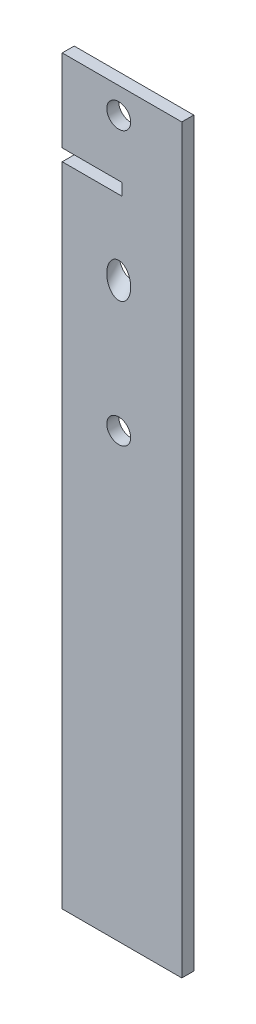
ISO-10303-21;
HEADER;
FILE_DESCRIPTION(('STEP AP214'),'2;1');
FILE_NAME('part.step','',(''),(''),'','','');
FILE_SCHEMA(('AUTOMOTIVE_DESIGN { 1 0 10303 214 1 1 1 1 }'));
ENDSEC;
DATA;
#1=APPLICATION_CONTEXT('core data for automotive mechanical design processes');
#2=APPLICATION_PROTOCOL_DEFINITION('international standard','automotive_design',2000,#1);
#3=PRODUCT_CONTEXT('',#1,'mechanical');
#4=PRODUCT('Part','Part','',(#3));
#5=PRODUCT_RELATED_PRODUCT_CATEGORY('part','',(#4));
#6=PRODUCT_DEFINITION_FORMATION('','',#4);
#7=PRODUCT_DEFINITION_CONTEXT('part definition',#1,'design');
#8=PRODUCT_DEFINITION('design','',#6,#7);
#9=PRODUCT_DEFINITION_SHAPE('','',#8);
#10=(LENGTH_UNIT() NAMED_UNIT(*) SI_UNIT(.MILLI.,.METRE.));
#11=(NAMED_UNIT(*) PLANE_ANGLE_UNIT() SI_UNIT($,.RADIAN.));
#12=(NAMED_UNIT(*) SI_UNIT($,.STERADIAN.) SOLID_ANGLE_UNIT());
#13=UNCERTAINTY_MEASURE_WITH_UNIT(LENGTH_MEASURE(1.E-05),#10,'distance_accuracy_value','');
#14=(GEOMETRIC_REPRESENTATION_CONTEXT(3) GLOBAL_UNCERTAINTY_ASSIGNED_CONTEXT((#13)) GLOBAL_UNIT_ASSIGNED_CONTEXT((#10,
#11,#12)) REPRESENTATION_CONTEXT('',''));
#15=CARTESIAN_POINT('',(0.,0.,0.));
#16=DIRECTION('',(0.,0.,1.));
#17=DIRECTION('',(1.,0.,0.));
#18=AXIS2_PLACEMENT_3D('',#15,#16,#17);
#19=CARTESIAN_POINT('',(2540.,317.5,131.142086105115));
#20=DIRECTION('',(1.,0.,0.));
#21=DIRECTION('',(0.,0.,-1.));
#22=AXIS2_PLACEMENT_3D('',#19,#20,#21);
#23=PLANE('',#22);
#24=DIRECTION('',(0.,0.,1.));
#25=VECTOR('',#24,1.);
#26=CARTESIAN_POINT('',(2540.,217.4,-190.5));
#27=LINE('',#26,#25);
#28=CARTESIAN_POINT('',(2540.,217.4,131.142086105115));
#29=VERTEX_POINT('',#28);
#30=CARTESIAN_POINT('',(2540.,217.4,143.842086105115));
#31=VERTEX_POINT('',#30);
#32=EDGE_CURVE('E95',#29,#31,#27,.T.);
#33=ORIENTED_EDGE('',*,*,#32,.F.);
#34=DIRECTION('',(0.,-1.,0.));
#35=VECTOR('',#34,1.);
#36=CARTESIAN_POINT('',(2540.,317.5,131.142086105115));
#37=LINE('',#36,#35);
#38=CARTESIAN_POINT('',(2540.,-469.9,131.142086105115));
#39=VERTEX_POINT('',#38);
#40=EDGE_CURVE('E104',#29,#39,#37,.T.);
#41=ORIENTED_EDGE('',*,*,#40,.T.);
#42=DIRECTION('',(0.,0.,1.));
#43=VECTOR('',#42,1.);
#44=CARTESIAN_POINT('',(2540.,-469.9,131.142086105115));
#45=LINE('',#44,#43);
#46=CARTESIAN_POINT('',(2540.,-469.9,143.842086105115));
#47=VERTEX_POINT('',#46);
#48=EDGE_CURVE('E107',#39,#47,#45,.T.);
#49=ORIENTED_EDGE('',*,*,#48,.T.);
#50=DIRECTION('',(0.,-1.,0.));
#51=VECTOR('',#50,1.);
#52=CARTESIAN_POINT('',(2540.,317.5,143.842086105115));
#53=LINE('',#52,#51);
#54=EDGE_CURVE('E61',#31,#47,#53,.T.);
#55=ORIENTED_EDGE('',*,*,#54,.F.);
#56=EDGE_LOOP('',(#33,#41,#49,#55));
#57=FACE_BOUND('',#56,.T.);
#58=ADVANCED_FACE('F37',(#57),#23,.F.);
#59=CARTESIAN_POINT('',(2540.,317.5,131.142086105115));
#60=VERTEX_POINT('',#59);
#61=CARTESIAN_POINT('',(2540.,230.1,131.142086105115));
#62=VERTEX_POINT('',#61);
#63=EDGE_CURVE('E110',#60,#62,#37,.T.);
#64=ORIENTED_EDGE('',*,*,#63,.T.);
#65=DIRECTION('',(0.,0.,1.));
#66=VECTOR('',#65,1.);
#67=CARTESIAN_POINT('',(2540.,230.1,-190.5));
#68=LINE('',#67,#66);
#69=CARTESIAN_POINT('',(2540.,230.1,143.842086105115));
#70=VERTEX_POINT('',#69);
#71=EDGE_CURVE('E52',#62,#70,#68,.T.);
#72=ORIENTED_EDGE('',*,*,#71,.T.);
#73=CARTESIAN_POINT('',(2540.,317.5,143.842086105115));
#74=VERTEX_POINT('',#73);
#75=EDGE_CURVE('E164',#74,#70,#53,.T.);
#76=ORIENTED_EDGE('',*,*,#75,.F.);
#77=DIRECTION('',(0.,0.,1.));
#78=VECTOR('',#77,1.);
#79=CARTESIAN_POINT('',(2540.,317.5,131.142086105115));
#80=LINE('',#79,#78);
#81=EDGE_CURVE('E137',#60,#74,#80,.T.);
#82=ORIENTED_EDGE('',*,*,#81,.F.);
#83=EDGE_LOOP('',(#64,#72,#76,#82));
#84=FACE_BOUND('',#83,.T.);
#85=ADVANCED_FACE('F159',(#84),#23,.F.);
#86=CARTESIAN_POINT('',(2540.,317.5,143.842086105115));
#87=DIRECTION('',(0.,0.,-1.));
#88=DIRECTION('',(-1.,0.,0.));
#89=AXIS2_PLACEMENT_3D('',#86,#87,#88);
#90=PLANE('',#89);
#91=CARTESIAN_POINT('',(2599.99999999996,289.999999999996,143.842086105115));
#92=DIRECTION('',(0.,0.,-1.));
#93=DIRECTION('',(-1.,0.,0.));
#94=AXIS2_PLACEMENT_3D('',#91,#92,#93);
#95=CIRCLE('',#94,12.6999999999999);
#96=CARTESIAN_POINT('',(2587.29999999996,289.999999999996,143.842086105115));
#97=VERTEX_POINT('',#96);
#98=EDGE_CURVE('E139',#97,#97,#95,.F.);
#99=ORIENTED_EDGE('',*,*,#98,.F.);
#100=EDGE_LOOP('',(#99));
#101=FACE_BOUND('',#100,.T.);
#102=ORIENTED_EDGE('',*,*,#75,.T.);
#103=DIRECTION('',(1.,0.,0.));
#104=VECTOR('',#103,1.);
#105=CARTESIAN_POINT('',(2540.,230.1,143.842086105115));
#106=LINE('',#105,#104);
#107=CARTESIAN_POINT('',(2603.5,230.1,143.842086105115));
#108=VERTEX_POINT('',#107);
#109=EDGE_CURVE('E126',#70,#108,#106,.T.);
#110=ORIENTED_EDGE('',*,*,#109,.T.);
#111=DIRECTION('',(0.,1.,0.));
#112=VECTOR('',#111,1.);
#113=CARTESIAN_POINT('',(2603.5,217.4,143.842086105115));
#114=LINE('',#113,#112);
#115=CARTESIAN_POINT('',(2603.5,217.4,143.842086105115));
#116=VERTEX_POINT('',#115);
#117=EDGE_CURVE('E176',#116,#108,#114,.T.);
#118=ORIENTED_EDGE('',*,*,#117,.F.);
#119=DIRECTION('',(1.,0.,0.));
#120=VECTOR('',#119,1.);
#121=CARTESIAN_POINT('',(2540.,217.4,143.842086105115));
#122=LINE('',#121,#120);
#123=EDGE_CURVE('E124',#31,#116,#122,.T.);
#124=ORIENTED_EDGE('',*,*,#123,.F.);
#125=ORIENTED_EDGE('',*,*,#54,.T.);
#126=DIRECTION('',(1.,0.,0.));
#127=VECTOR('',#126,1.);
#128=CARTESIAN_POINT('',(2540.,-469.9,143.842086105115));
#129=LINE('',#128,#127);
#130=CARTESIAN_POINT('',(2667.,-469.9,143.842086105115));
#131=VERTEX_POINT('',#130);
#132=EDGE_CURVE('E123',#47,#131,#129,.T.);
#133=ORIENTED_EDGE('',*,*,#132,.T.);
#134=DIRECTION('',(0.,-1.,0.));
#135=VECTOR('',#134,1.);
#136=CARTESIAN_POINT('',(2667.,317.5,143.842086105115));
#137=LINE('',#136,#135);
#138=CARTESIAN_POINT('',(2667.,317.5,143.842086105115));
#139=VERTEX_POINT('',#138);
#140=EDGE_CURVE('E88',#139,#131,#137,.T.);
#141=ORIENTED_EDGE('',*,*,#140,.F.);
#142=DIRECTION('',(1.,0.,0.));
#143=VECTOR('',#142,1.);
#144=CARTESIAN_POINT('',(2540.,317.5,143.842086105115));
#145=LINE('',#144,#143);
#146=EDGE_CURVE('E80',#74,#139,#145,.T.);
#147=ORIENTED_EDGE('',*,*,#146,.F.);
#148=EDGE_LOOP('',(#102,#110,#118,#124,#125,#133,#141,#147));
#149=FACE_BOUND('',#148,.T.);
#150=CARTESIAN_POINT('',(2599.99999999996,138.311981925511,143.842086105115));
#151=DIRECTION('',(0.,0.,-1.));
#152=DIRECTION('',(0.,-1.,0.));
#153=AXIS2_PLACEMENT_3D('',#150,#151,#152);
#154=ELLIPSE('',#153,18.4568454455697,12.6999999999999);
#155=CARTESIAN_POINT('',(2599.99999999996,119.855136479941,143.842086105115));
#156=VERTEX_POINT('',#155);
#157=EDGE_CURVE('E147',#156,#156,#154,.F.);
#158=ORIENTED_EDGE('',*,*,#157,.F.);
#159=EDGE_LOOP('',(#158));
#160=FACE_BOUND('',#159,.T.);
#161=CARTESIAN_POINT('',(2599.99999999996,-3.18538321897636E-12,143.842086105115));
#162=DIRECTION('',(0.,0.,-1.));
#163=DIRECTION('',(-1.,0.,0.));
#164=AXIS2_PLACEMENT_3D('',#161,#162,#163);
#165=CIRCLE('',#164,12.6999999999999);
#166=CARTESIAN_POINT('',(2587.29999999996,-3.18538321897636E-12,143.842086105115));
#167=VERTEX_POINT('',#166);
#168=EDGE_CURVE('E143',#167,#167,#165,.F.);
#169=ORIENTED_EDGE('',*,*,#168,.F.);
#170=EDGE_LOOP('',(#169));
#171=FACE_BOUND('',#170,.T.);
#172=ADVANCED_FACE('F39',(#101,#149,#160,#171),#90,.F.);
#173=CARTESIAN_POINT('',(2667.,317.5,131.142086105115));
#174=DIRECTION('',(-1.,0.,0.));
#175=DIRECTION('',(0.,0.,1.));
#176=AXIS2_PLACEMENT_3D('',#173,#174,#175);
#177=PLANE('',#176);
#178=DIRECTION('',(0.,0.,-1.));
#179=VECTOR('',#178,1.);
#180=CARTESIAN_POINT('',(2667.,-469.9,131.142086105115));
#181=LINE('',#180,#179);
#182=CARTESIAN_POINT('',(2667.,-469.9,131.142086105115));
#183=VERTEX_POINT('',#182);
#184=EDGE_CURVE('E163',#131,#183,#181,.T.);
#185=ORIENTED_EDGE('',*,*,#184,.T.);
#186=DIRECTION('',(0.,-1.,0.));
#187=VECTOR('',#186,1.);
#188=CARTESIAN_POINT('',(2667.,317.5,131.142086105115));
#189=LINE('',#188,#187);
#190=CARTESIAN_POINT('',(2667.,317.5,131.142086105115));
#191=VERTEX_POINT('',#190);
#192=EDGE_CURVE('E118',#191,#183,#189,.T.);
#193=ORIENTED_EDGE('',*,*,#192,.F.);
#194=DIRECTION('',(0.,0.,-1.));
#195=VECTOR('',#194,1.);
#196=CARTESIAN_POINT('',(2667.,317.5,131.142086105115));
#197=LINE('',#196,#195);
#198=EDGE_CURVE('E134',#139,#191,#197,.T.);
#199=ORIENTED_EDGE('',*,*,#198,.F.);
#200=ORIENTED_EDGE('',*,*,#140,.T.);
#201=EDGE_LOOP('',(#185,#193,#199,#200));
#202=FACE_BOUND('',#201,.T.);
#203=ADVANCED_FACE('F214',(#202),#177,.F.);
#204=CARTESIAN_POINT('',(2540.,317.5,131.142086105115));
#205=DIRECTION('',(0.,0.,1.));
#206=DIRECTION('',(1.,0.,0.));
#207=AXIS2_PLACEMENT_3D('',#204,#205,#206);
#208=PLANE('',#207);
#209=CARTESIAN_POINT('',(2599.99999999996,289.999999999996,131.142086105115));
#210=DIRECTION('',(0.,0.,1.));
#211=DIRECTION('',(1.,0.,0.));
#212=AXIS2_PLACEMENT_3D('',#209,#210,#211);
#213=CIRCLE('',#212,12.6999999999999);
#214=CARTESIAN_POINT('',(2612.69999999996,289.999999999996,131.142086105115));
#215=VERTEX_POINT('',#214);
#216=EDGE_CURVE('E142',#215,#215,#213,.F.);
#217=ORIENTED_EDGE('',*,*,#216,.F.);
#218=EDGE_LOOP('',(#217));
#219=FACE_BOUND('',#218,.T.);
#220=ORIENTED_EDGE('',*,*,#192,.T.);
#221=DIRECTION('',(-1.,0.,0.));
#222=VECTOR('',#221,1.);
#223=CARTESIAN_POINT('',(2540.,-469.9,131.142086105115));
#224=LINE('',#223,#222);
#225=EDGE_CURVE('E113',#183,#39,#224,.T.);
#226=ORIENTED_EDGE('',*,*,#225,.T.);
#227=ORIENTED_EDGE('',*,*,#40,.F.);
#228=DIRECTION('',(-1.,0.,0.));
#229=VECTOR('',#228,1.);
#230=CARTESIAN_POINT('',(2540.,217.4,131.142086105115));
#231=LINE('',#230,#229);
#232=CARTESIAN_POINT('',(2603.5,217.4,131.142086105115));
#233=VERTEX_POINT('',#232);
#234=EDGE_CURVE('E11',#233,#29,#231,.T.);
#235=ORIENTED_EDGE('',*,*,#234,.F.);
#236=DIRECTION('',(0.,1.,0.));
#237=VECTOR('',#236,1.);
#238=CARTESIAN_POINT('',(2603.5,217.4,131.142086105115));
#239=LINE('',#238,#237);
#240=CARTESIAN_POINT('',(2603.5,230.1,131.142086105115));
#241=VERTEX_POINT('',#240);
#242=EDGE_CURVE('E155',#233,#241,#239,.T.);
#243=ORIENTED_EDGE('',*,*,#242,.T.);
#244=DIRECTION('',(-1.,0.,0.));
#245=VECTOR('',#244,1.);
#246=CARTESIAN_POINT('',(2540.,230.1,131.142086105115));
#247=LINE('',#246,#245);
#248=EDGE_CURVE('E45',#241,#62,#247,.T.);
#249=ORIENTED_EDGE('',*,*,#248,.T.);
#250=ORIENTED_EDGE('',*,*,#63,.F.);
#251=DIRECTION('',(-1.,0.,0.));
#252=VECTOR('',#251,1.);
#253=CARTESIAN_POINT('',(2540.,317.5,131.142086105115));
#254=LINE('',#253,#252);
#255=EDGE_CURVE('E131',#191,#60,#254,.T.);
#256=ORIENTED_EDGE('',*,*,#255,.F.);
#257=EDGE_LOOP('',(#220,#226,#227,#235,#243,#249,#250,#256));
#258=FACE_BOUND('',#257,.T.);
#259=CARTESIAN_POINT('',(2599.99999999996,-3.08879701567193E-12,131.142086105115));
#260=DIRECTION('',(0.,0.,1.));
#261=DIRECTION('',(1.,0.,0.));
#262=AXIS2_PLACEMENT_3D('',#259,#260,#261);
#263=CIRCLE('',#262,12.6999999999999);
#264=CARTESIAN_POINT('',(2612.69999999996,-3.08879701567193E-12,131.142086105115));
#265=VERTEX_POINT('',#264);
#266=EDGE_CURVE('E146',#265,#265,#263,.F.);
#267=ORIENTED_EDGE('',*,*,#266,.F.);
#268=EDGE_LOOP('',(#267));
#269=FACE_BOUND('',#268,.T.);
#270=CARTESIAN_POINT('',(2599.99999999996,151.704709198238,131.142086105115));
#271=DIRECTION('',(0.,0.,1.));
#272=DIRECTION('',(0.,-1.,0.));
#273=AXIS2_PLACEMENT_3D('',#270,#271,#272);
#274=ELLIPSE('',#273,18.4568454455697,12.6999999999999);
#275=CARTESIAN_POINT('',(2599.99999999996,133.247863752668,131.142086105115));
#276=VERTEX_POINT('',#275);
#277=EDGE_CURVE('E133',#276,#276,#274,.F.);
#278=ORIENTED_EDGE('',*,*,#277,.F.);
#279=EDGE_LOOP('',(#278));
#280=FACE_BOUND('',#279,.T.);
#281=ADVANCED_FACE('F114',(#219,#258,#269,#280),#208,.F.);
#282=CARTESIAN_POINT('',(0.,317.5,0.));
#283=DIRECTION('',(0.,1.,0.));
#284=DIRECTION('',(0.,0.,1.));
#285=AXIS2_PLACEMENT_3D('',#282,#283,#284);
#286=PLANE('',#285);
#287=ORIENTED_EDGE('',*,*,#81,.T.);
#288=ORIENTED_EDGE('',*,*,#146,.T.);
#289=ORIENTED_EDGE('',*,*,#198,.T.);
#290=ORIENTED_EDGE('',*,*,#255,.T.);
#291=EDGE_LOOP('',(#287,#288,#289,#290));
#292=FACE_BOUND('',#291,.T.);
#293=ADVANCED_FACE('F220',(#292),#286,.T.);
#294=CARTESIAN_POINT('',(0.,-469.9,0.));
#295=DIRECTION('',(0.,1.,0.));
#296=DIRECTION('',(0.,0.,1.));
#297=AXIS2_PLACEMENT_3D('',#294,#295,#296);
#298=PLANE('',#297);
#299=ORIENTED_EDGE('',*,*,#48,.F.);
#300=ORIENTED_EDGE('',*,*,#225,.F.);
#301=ORIENTED_EDGE('',*,*,#184,.F.);
#302=ORIENTED_EDGE('',*,*,#132,.F.);
#303=EDGE_LOOP('',(#299,#300,#301,#302));
#304=FACE_BOUND('',#303,.T.);
#305=ADVANCED_FACE('F122',(#304),#298,.F.);
#306=CARTESIAN_POINT('',(2599.99999999996,289.999999999996,-4.44089209850063E-13));
#307=DIRECTION('',(0.,-0.725623851173434,0.688091583009292));
#308=DIRECTION('',(0.,-0.688091583009292,-0.725623851173434));
#309=AXIS2_PLACEMENT_3D('',#306,#307,#308);
#310=CYLINDRICAL_SURFACE('',#309,12.6999999999999);
#311=ORIENTED_EDGE('',*,*,#277,.T.);
#312=EDGE_LOOP('',(#311));
#313=FACE_BOUND('',#312,.T.);
#314=ORIENTED_EDGE('',*,*,#157,.T.);
#315=EDGE_LOOP('',(#314));
#316=FACE_BOUND('',#315,.T.);
#317=ADVANCED_FACE('F219',(#313,#316),#310,.F.);
#318=CARTESIAN_POINT('',(2599.99999999996,0.,-275.000000000001));
#319=DIRECTION('',(0.,0.,1.));
#320=DIRECTION('',(0.,-1.,0.));
#321=AXIS2_PLACEMENT_3D('',#318,#319,#320);
#322=CYLINDRICAL_SURFACE('',#321,12.6999999999999);
#323=ORIENTED_EDGE('',*,*,#266,.T.);
#324=EDGE_LOOP('',(#323));
#325=FACE_BOUND('',#324,.T.);
#326=ORIENTED_EDGE('',*,*,#168,.T.);
#327=EDGE_LOOP('',(#326));
#328=FACE_BOUND('',#327,.T.);
#329=ADVANCED_FACE('F224',(#325,#328),#322,.F.);
#330=CARTESIAN_POINT('',(2599.99999999996,289.999999999996,275.));
#331=DIRECTION('',(0.,0.,-1.));
#332=DIRECTION('',(0.,1.,0.));
#333=AXIS2_PLACEMENT_3D('',#330,#331,#332);
#334=CYLINDRICAL_SURFACE('',#333,12.6999999999999);
#335=ORIENTED_EDGE('',*,*,#216,.T.);
#336=EDGE_LOOP('',(#335));
#337=FACE_BOUND('',#336,.T.);
#338=ORIENTED_EDGE('',*,*,#98,.T.);
#339=EDGE_LOOP('',(#338));
#340=FACE_BOUND('',#339,.T.);
#341=ADVANCED_FACE('F206',(#337,#340),#334,.F.);
#342=CARTESIAN_POINT('',(0.,217.4,0.));
#343=DIRECTION('',(0.,1.,0.));
#344=DIRECTION('',(0.,0.,1.));
#345=AXIS2_PLACEMENT_3D('',#342,#343,#344);
#346=PLANE('',#345);
#347=ORIENTED_EDGE('',*,*,#123,.T.);
#348=DIRECTION('',(0.,0.,-1.));
#349=VECTOR('',#348,1.);
#350=CARTESIAN_POINT('',(2603.5,217.4,143.842086105115));
#351=LINE('',#350,#349);
#352=EDGE_CURVE('E180',#116,#233,#351,.T.);
#353=ORIENTED_EDGE('',*,*,#352,.T.);
#354=ORIENTED_EDGE('',*,*,#234,.T.);
#355=ORIENTED_EDGE('',*,*,#32,.T.);
#356=EDGE_LOOP('',(#347,#353,#354,#355));
#357=FACE_BOUND('',#356,.T.);
#358=ADVANCED_FACE('F187',(#357),#346,.T.);
#359=CARTESIAN_POINT('',(0.,230.1,0.));
#360=DIRECTION('',(0.,1.,0.));
#361=DIRECTION('',(0.,0.,1.));
#362=AXIS2_PLACEMENT_3D('',#359,#360,#361);
#363=PLANE('',#362);
#364=ORIENTED_EDGE('',*,*,#71,.F.);
#365=ORIENTED_EDGE('',*,*,#248,.F.);
#366=DIRECTION('',(0.,0.,-1.));
#367=VECTOR('',#366,1.);
#368=CARTESIAN_POINT('',(2603.5,230.1,143.842086105115));
#369=LINE('',#368,#367);
#370=EDGE_CURVE('E175',#108,#241,#369,.T.);
#371=ORIENTED_EDGE('',*,*,#370,.F.);
#372=ORIENTED_EDGE('',*,*,#109,.F.);
#373=EDGE_LOOP('',(#364,#365,#371,#372));
#374=FACE_BOUND('',#373,.T.);
#375=ADVANCED_FACE('F197',(#374),#363,.F.);
#376=CARTESIAN_POINT('',(2603.5,217.4,143.842086105115));
#377=DIRECTION('',(1.,0.,0.));
#378=DIRECTION('',(0.,0.,-1.));
#379=AXIS2_PLACEMENT_3D('',#376,#377,#378);
#380=PLANE('',#379);
#381=ORIENTED_EDGE('',*,*,#370,.T.);
#382=ORIENTED_EDGE('',*,*,#242,.F.);
#383=ORIENTED_EDGE('',*,*,#352,.F.);
#384=ORIENTED_EDGE('',*,*,#117,.T.);
#385=EDGE_LOOP('',(#381,#382,#383,#384));
#386=FACE_BOUND('',#385,.T.);
#387=ADVANCED_FACE('F192',(#386),#380,.F.);
#388=CLOSED_SHELL('',(#58,#85,#172,#203,#281,#293,#305,#317,#329,#341,#358,#375,#387));
#389=MANIFOLD_SOLID_BREP('B2',#388);
#390=ADVANCED_BREP_SHAPE_REPRESENTATION('',(#18,#389),#14);
#391=SHAPE_DEFINITION_REPRESENTATION(#9,#390);
ENDSEC;
END-ISO-10303-21;
